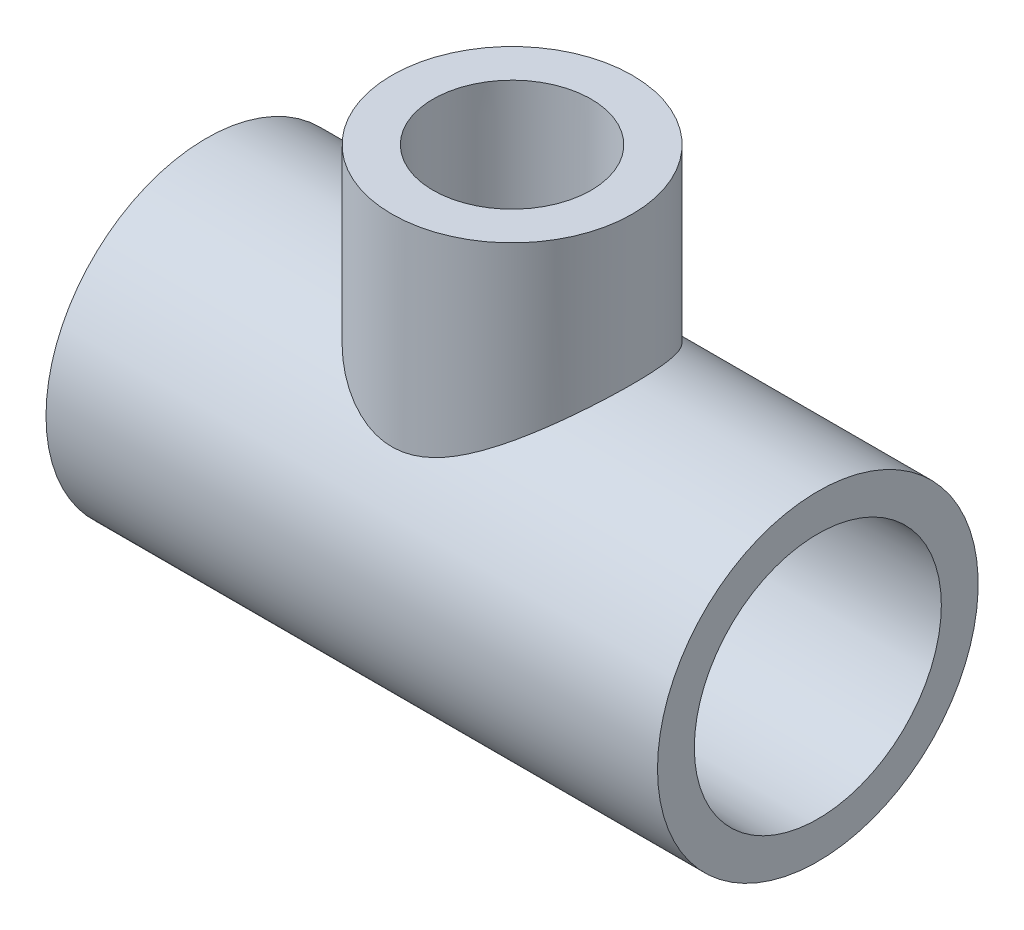
ISO-10303-21;
HEADER;
FILE_DESCRIPTION(('STEP AP214'),'2;1');
FILE_NAME('part.step','',(''),(''),'','','');
FILE_SCHEMA(('AUTOMOTIVE_DESIGN { 1 0 10303 214 1 1 1 1 }'));
ENDSEC;
DATA;
#1=APPLICATION_CONTEXT('core data for automotive mechanical design processes');
#2=APPLICATION_PROTOCOL_DEFINITION('international standard','automotive_design',2000,#1);
#3=PRODUCT_CONTEXT('',#1,'mechanical');
#4=PRODUCT('Part','Part','',(#3));
#5=PRODUCT_RELATED_PRODUCT_CATEGORY('part','',(#4));
#6=PRODUCT_DEFINITION_FORMATION('','',#4);
#7=PRODUCT_DEFINITION_CONTEXT('part definition',#1,'design');
#8=PRODUCT_DEFINITION('design','',#6,#7);
#9=PRODUCT_DEFINITION_SHAPE('','',#8);
#10=(LENGTH_UNIT() NAMED_UNIT(*) SI_UNIT(.MILLI.,.METRE.));
#11=(NAMED_UNIT(*) PLANE_ANGLE_UNIT() SI_UNIT($,.RADIAN.));
#12=(NAMED_UNIT(*) SI_UNIT($,.STERADIAN.) SOLID_ANGLE_UNIT());
#13=UNCERTAINTY_MEASURE_WITH_UNIT(LENGTH_MEASURE(1.E-05),#10,'distance_accuracy_value','');
#14=(GEOMETRIC_REPRESENTATION_CONTEXT(3) GLOBAL_UNCERTAINTY_ASSIGNED_CONTEXT((#13)) GLOBAL_UNIT_ASSIGNED_CONTEXT((#10,
#11,#12)) REPRESENTATION_CONTEXT('',''));
#15=CARTESIAN_POINT('',(0.,0.,0.));
#16=DIRECTION('',(0.,0.,1.));
#17=DIRECTION('',(1.,0.,0.));
#18=AXIS2_PLACEMENT_3D('',#15,#16,#17);
#19=CARTESIAN_POINT('',(-12.7,0.,0.));
#20=DIRECTION('',(1.,0.,0.));
#21=DIRECTION('',(0.,0.,-1.));
#22=AXIS2_PLACEMENT_3D('',#19,#20,#21);
#23=PLANE('',#22);
#24=CARTESIAN_POINT('',(-12.7,0.,0.));
#25=DIRECTION('',(-1.,0.,0.));
#26=DIRECTION('',(0.,0.,1.));
#27=AXIS2_PLACEMENT_3D('',#24,#25,#26);
#28=CIRCLE('',#27,16.637);
#29=CARTESIAN_POINT('',(-12.7,0.,16.637));
#30=VERTEX_POINT('',#29);
#31=EDGE_CURVE('E94',#30,#30,#28,.T.);
#32=ORIENTED_EDGE('',*,*,#31,.T.);
#33=EDGE_LOOP('',(#32));
#34=FACE_BOUND('',#33,.T.);
#35=CARTESIAN_POINT('',(-12.7,0.,0.));
#36=DIRECTION('',(1.,0.,0.));
#37=DIRECTION('',(0.,0.,-1.));
#38=AXIS2_PLACEMENT_3D('',#35,#36,#37);
#39=CIRCLE('',#38,12.1539);
#40=CARTESIAN_POINT('',(-12.7,0.,-12.1539));
#41=VERTEX_POINT('',#40);
#42=EDGE_CURVE('E97',#41,#41,#39,.T.);
#43=ORIENTED_EDGE('',*,*,#42,.T.);
#44=EDGE_LOOP('',(#43));
#45=FACE_BOUND('',#44,.T.);
#46=ADVANCED_FACE('F30',(#34,#45),#23,.F.);
#47=CARTESIAN_POINT('',(12.7,0.,0.));
#48=DIRECTION('',(1.,0.,0.));
#49=DIRECTION('',(0.,0.,-1.));
#50=AXIS2_PLACEMENT_3D('',#47,#48,#49);
#51=PLANE('',#50);
#52=CARTESIAN_POINT('',(12.7,0.,0.));
#53=DIRECTION('',(1.,0.,0.));
#54=DIRECTION('',(0.,0.,-1.));
#55=AXIS2_PLACEMENT_3D('',#52,#53,#54);
#56=CIRCLE('',#55,12.1539);
#57=CARTESIAN_POINT('',(12.7,0.,-12.1539));
#58=VERTEX_POINT('',#57);
#59=EDGE_CURVE('E100',#58,#58,#56,.T.);
#60=ORIENTED_EDGE('',*,*,#59,.F.);
#61=EDGE_LOOP('',(#60));
#62=FACE_BOUND('',#61,.T.);
#63=CARTESIAN_POINT('',(12.7,0.,0.));
#64=DIRECTION('',(1.,0.,0.));
#65=DIRECTION('',(0.,0.,-1.));
#66=AXIS2_PLACEMENT_3D('',#63,#64,#65);
#67=CIRCLE('',#66,16.637);
#68=CARTESIAN_POINT('',(12.7,0.,-16.637));
#69=VERTEX_POINT('',#68);
#70=EDGE_CURVE('E10',#69,#69,#67,.F.);
#71=ORIENTED_EDGE('',*,*,#70,.F.);
#72=EDGE_LOOP('',(#71));
#73=FACE_BOUND('',#72,.T.);
#74=ADVANCED_FACE('F69',(#62,#73),#51,.T.);
#75=CARTESIAN_POINT('',(12.7,0.,0.));
#76=DIRECTION('',(-1.,0.,0.));
#77=DIRECTION('',(0.,0.,1.));
#78=AXIS2_PLACEMENT_3D('',#75,#76,#77);
#79=CYLINDRICAL_SURFACE('',#78,21.844);
#80=CARTESIAN_POINT('',(-41.656,0.,0.));
#81=DIRECTION('',(-1.,0.,0.));
#82=DIRECTION('',(0.,0.,1.));
#83=AXIS2_PLACEMENT_3D('',#80,#81,#82);
#84=CIRCLE('',#83,21.844);
#85=CARTESIAN_POINT('',(-41.656,0.,21.844));
#86=VERTEX_POINT('',#85);
#87=EDGE_CURVE('E111',#86,#86,#84,.T.);
#88=ORIENTED_EDGE('',*,*,#87,.F.);
#89=EDGE_LOOP('',(#88));
#90=FACE_BOUND('',#89,.T.);
#91=CARTESIAN_POINT('',(41.656,0.,0.));
#92=DIRECTION('',(-1.,0.,0.));
#93=DIRECTION('',(0.,0.,1.));
#94=AXIS2_PLACEMENT_3D('',#91,#92,#93);
#95=CIRCLE('',#94,21.844);
#96=CARTESIAN_POINT('',(41.656,0.,21.844));
#97=VERTEX_POINT('',#96);
#98=EDGE_CURVE('E99',#97,#97,#95,.T.);
#99=ORIENTED_EDGE('',*,*,#98,.T.);
#100=EDGE_LOOP('',(#99));
#101=FACE_BOUND('',#100,.T.);
#102=CARTESIAN_POINT('',(-12.7,19.2366225465906,10.3495260277947));
#103=CARTESIAN_POINT('',(-12.38737162527,19.0302252353662,10.7331552467924));
#104=CARTESIAN_POINT('',(-12.0590114334823,18.8177169338673,11.1006174604114));
#105=CARTESIAN_POINT('',(-11.3728127983381,18.3855218332712,11.8026654761243));
#106=CARTESIAN_POINT('',(-11.0149596171085,18.1658314787354,12.1372346559506));
#107=CARTESIAN_POINT('',(-10.2706419831162,17.7243819909756,12.7732836382412));
#108=CARTESIAN_POINT('',(-9.88412017979884,17.5026195313519,13.0746939458155));
#109=CARTESIAN_POINT('',(-9.08404819443392,17.0635778234126,13.6427038422154));
#110=CARTESIAN_POINT('',(-8.67050700181132,16.8462971153419,13.9093149212335));
#111=CARTESIAN_POINT('',(-7.90903440214053,16.4689440947041,14.352691086896));
#112=CARTESIAN_POINT('',(-7.56624136939487,16.3066573784344,14.5364203328138));
#113=CARTESIAN_POINT('',(-6.86431224493976,15.9930557105811,14.8807494560404));
#114=CARTESIAN_POINT('',(-6.50517606181844,15.8417408203783,15.0413492039583));
#115=CARTESIAN_POINT('',(-5.77182638209687,15.5550006688472,15.3376890963806));
#116=CARTESIAN_POINT('',(-5.39765452404665,15.4195351086607,15.4734928040575));
#117=CARTESIAN_POINT('',(-4.63402477698114,15.1691094774438,15.7190730793771));
#118=CARTESIAN_POINT('',(-4.24456621640272,15.0541503085165,15.8288485020712));
#119=CARTESIAN_POINT('',(-3.54569518456714,14.8742744020657,15.9977413431733));
#120=CARTESIAN_POINT('',(-3.2390806564975,14.803950316516,16.0627000260346));
#121=CARTESIAN_POINT('',(-2.61935745093335,14.6808234658039,16.1753126147721));
#122=CARTESIAN_POINT('',(-2.30625269908129,14.6280104196909,16.2229766760936));
#123=CARTESIAN_POINT('',(-1.67544331465814,14.5419140056493,16.3001974153157));
#124=CARTESIAN_POINT('',(-1.35774345447337,14.5086116843102,16.3297716675336));
#125=CARTESIAN_POINT('',(-0.719641071933917,14.4628590160885,16.3703082945965));
#126=CARTESIAN_POINT('',(-0.39923854268686,14.450408722399,16.3812706219628));
#127=CARTESIAN_POINT('',(0.242445071122503,14.4469124642276,16.3843542346649));
#128=CARTESIAN_POINT('',(0.563726593949816,14.4559112128609,16.3764361615159));
#129=CARTESIAN_POINT('',(1.20396562771779,14.4950011021887,16.3418464983307));
#130=CARTESIAN_POINT('',(1.5229231476199,14.525092161507,16.315174980647));
#131=CARTESIAN_POINT('',(2.15662279904977,14.60512661813,16.2435672832095));
#132=CARTESIAN_POINT('',(2.47135944563514,14.655093664508,16.1986093442564));
#133=CARTESIAN_POINT('',(3.09441871182437,14.7729282615893,16.0912167549626));
#134=CARTESIAN_POINT('',(3.40274039319044,14.8407984111774,16.0287795671847));
#135=CARTESIAN_POINT('',(4.1072256247016,15.0158863092918,15.8651191251578));
#136=CARTESIAN_POINT('',(4.50058859868365,15.1287679837384,15.7578730388132));
#137=CARTESIAN_POINT('',(5.27212930843681,15.375930066885,15.5167930794521));
#138=CARTESIAN_POINT('',(5.65030187137645,15.5102176889498,15.3829502401131));
#139=CARTESIAN_POINT('',(6.39141830989837,15.7952708424237,15.0901154399997));
#140=CARTESIAN_POINT('',(6.75432459312845,15.9460740909881,14.9310655269177));
#141=CARTESIAN_POINT('',(7.46362496984504,16.2592155024214,14.5894471079966));
#142=CARTESIAN_POINT('',(7.81001888027989,16.4215537931151,14.406878341517));
#143=CARTESIAN_POINT('',(8.58466906108283,16.8020666999503,13.9627860748959));
#144=CARTESIAN_POINT('',(9.00740597239244,17.0227400315694,13.6937487511206));
#145=CARTESIAN_POINT('',(9.82490987765167,17.4690953555553,13.1195806907376));
#146=CARTESIAN_POINT('',(10.2196685254737,17.6947788163354,12.8144392558603));
#147=CARTESIAN_POINT('',(10.979990782657,18.1445312029231,12.1692594571232));
#148=CARTESIAN_POINT('',(11.3455747974031,18.3686011556714,11.8292458708072));
#149=CARTESIAN_POINT('',(12.0462308627125,18.809445592615,11.1149077204525));
#150=CARTESIAN_POINT('',(12.3813115447744,19.026222129607,10.7405929231314));
#151=CARTESIAN_POINT('',(12.9593802213773,19.4078672397707,10.0312370649456));
#152=CARTESIAN_POINT('',(13.2079017134634,19.5748881894783,9.70185098275879));
#153=CARTESIAN_POINT('',(13.6816294490335,19.8976019034885,9.0214999428057));
#154=CARTESIAN_POINT('',(13.906840106962,20.0532968109728,8.67053909085872));
#155=CARTESIAN_POINT('',(14.3318817379855,20.350366383037,7.94828592046748));
#156=CARTESIAN_POINT('',(14.5317377327227,20.49175513752,7.57701417239248));
#157=CARTESIAN_POINT('',(14.9042092723667,20.7575547244252,6.81519830278495));
#158=CARTESIAN_POINT('',(15.076827922905,20.8819674922488,6.4246563851336));
#159=CARTESIAN_POINT('',(15.3728204278317,21.0967352415774,5.67627570816755));
#160=CARTESIAN_POINT('',(15.499654276963,21.1894042517817,5.32046807040566));
#161=CARTESIAN_POINT('',(15.7293150014479,21.3579706401296,4.59730556156607));
#162=CARTESIAN_POINT('',(15.8321438758193,21.4338694147889,4.22995165489843));
#163=CARTESIAN_POINT('',(16.012416562649,21.567370306116,3.48592331677668));
#164=CARTESIAN_POINT('',(16.0898692080478,21.6249787890397,3.10925217766294));
#165=CARTESIAN_POINT('',(16.2183137953419,21.720716233426,2.34895879475537));
#166=CARTESIAN_POINT('',(16.2693055289336,21.7588450415423,1.96533649626579));
#167=CARTESIAN_POINT('',(16.3441444391592,21.8148592628047,1.19277030180853));
#168=CARTESIAN_POINT('',(16.3679073133331,21.8326818053666,0.803813631535926));
#169=CARTESIAN_POINT('',(16.3876138015941,21.8474595807421,0.0247951359414509));
#170=CARTESIAN_POINT('',(16.3835573098497,21.8444147341713,-0.365266693579066));
#171=CARTESIAN_POINT('',(16.34769047214,21.817527153199,-1.14343296098828));
#172=CARTESIAN_POINT('',(16.3158766473305,21.7936818118584,-1.53153714739183));
#173=CARTESIAN_POINT('',(16.2250078207658,21.7257362675007,-2.30272862769891));
#174=CARTESIAN_POINT('',(16.1659534551356,21.6816365374672,-2.68581603854008));
#175=CARTESIAN_POINT('',(16.0250115285092,21.5767592765038,-3.42588372631266));
#176=CARTESIAN_POINT('',(15.9443647720213,21.5168903053893,-3.78323120297709));
#177=CARTESIAN_POINT('',(15.7602764895552,21.3808353397447,-4.48879868540526));
#178=CARTESIAN_POINT('',(15.6568354580999,21.3046496992065,-4.8370188890023));
#179=CARTESIAN_POINT('',(15.4283792222684,21.1373243324452,-5.52252667614755));
#180=CARTESIAN_POINT('',(15.3033679608905,21.0461873394515,-5.85981624443428));
#181=CARTESIAN_POINT('',(15.0330756219717,20.8504759794269,-6.52206352972874));
#182=CARTESIAN_POINT('',(14.8877948143536,20.7459017913362,-6.84702141088019));
#183=CARTESIAN_POINT('',(14.4521370418577,20.434848871702,-7.74276698396327));
#184=CARTESIAN_POINT('',(14.139905927436,20.2147040312702,-8.29837024666278));
#185=CARTESIAN_POINT('',(13.4600371329359,19.7451188515364,-9.3610153478605));
#186=CARTESIAN_POINT('',(13.0923773967042,19.4956668590949,-9.86803772310501));
#187=CARTESIAN_POINT('',(12.3872653792398,19.0301577361515,-10.7332842759314));
#188=CARTESIAN_POINT('',(12.0588288904482,18.8175994143986,-11.1008220323835));
#189=CARTESIAN_POINT('',(11.3724689478728,18.3853078150025,-11.8029994320256));
#190=CARTESIAN_POINT('',(11.0145330614889,18.165571535984,-12.1376250726524));
#191=CARTESIAN_POINT('',(10.2702049880416,17.7241297925255,-12.7736310771484));
#192=CARTESIAN_POINT('',(9.88376741173228,17.5024217041293,-13.0749564169108));
#193=CARTESIAN_POINT('',(9.08386751925894,17.0634829269642,-13.6428200841769));
#194=CARTESIAN_POINT('',(8.67041365409696,16.8462508657463,-13.9093692126307));
#195=CARTESIAN_POINT('',(7.9090490445422,16.4689513433912,-14.3526826093123));
#196=CARTESIAN_POINT('',(7.56627148900179,16.3066716372532,-14.5364042016123));
#197=CARTESIAN_POINT('',(6.86437619967367,15.9930834815055,-14.8807194390151));
#198=CARTESIAN_POINT('',(6.50525844431151,15.8417750463823,-15.0413130535801));
#199=CARTESIAN_POINT('',(5.77191248532007,15.5550323267804,-15.3376571552622));
#200=CARTESIAN_POINT('',(5.39772441046526,15.419559205897,-15.4734689002737));
#201=CARTESIAN_POINT('',(4.63406076138454,15.1691201011686,-15.7190629343969));
#202=CARTESIAN_POINT('',(4.24458451590511,15.0541550189959,-15.828844079097));
#203=CARTESIAN_POINT('',(3.54569259816477,14.8742737359624,-15.9977419686909));
#204=CARTESIAN_POINT('',(3.23907542034374,14.8039491154811,-16.0627011355186));
#205=CARTESIAN_POINT('',(2.61934682255104,14.6808215146596,-16.17531438826));
#206=CARTESIAN_POINT('',(2.30623932853355,14.6280082525291,-16.2229786304416));
#207=CARTESIAN_POINT('',(1.67542979324863,14.5419125019922,-16.3001987533026));
#208=CARTESIAN_POINT('',(1.35773260789967,14.508610728243,-16.3297725160643));
#209=CARTESIAN_POINT('',(0.719635624006332,14.4628588037718,-16.3703084812258));
#210=CARTESIAN_POINT('',(0.399235818422133,14.4504087073815,-16.3812706351307));
#211=CARTESIAN_POINT('',(-0.242444828856007,14.4469124657222,-16.384354233424));
#212=CARTESIAN_POINT('',(-0.563726110444523,14.455911199315,-16.3764361734293));
#213=CARTESIAN_POINT('',(-1.20396466559519,14.495001027467,-16.3418465645212));
#214=CARTESIAN_POINT('',(-1.52292194812461,14.5250920405968,-16.3151750880076));
#215=CARTESIAN_POINT('',(-2.15662161334648,14.6051264377492,-16.2435674454124));
#216=CARTESIAN_POINT('',(-2.471358504164,14.6550935007574,-16.1986094926111));
#217=CARTESIAN_POINT('',(-3.09441824921853,14.7729281597842,-16.0912168486278));
#218=CARTESIAN_POINT('',(-3.40274016524305,14.8407983546182,-16.0287796200765));
#219=CARTESIAN_POINT('',(-4.10722201649837,15.0158854124114,-15.8651199634701));
#220=CARTESIAN_POINT('',(-4.50058150075528,15.1287659464657,-15.7578749742277));
#221=CARTESIAN_POINT('',(-5.27211551479685,15.3759254111821,-15.5167976722339));
#222=CARTESIAN_POINT('',(-5.65028487204106,15.5102115548262,-15.3829563936505));
#223=CARTESIAN_POINT('',(-6.39140187585219,15.7952641161734,-15.0901224981788));
#224=CARTESIAN_POINT('',(-6.75431163976959,15.946068542545,-14.9310714813334));
#225=CARTESIAN_POINT('',(-7.46361870433724,16.2592125661498,-14.5894504099462));
#226=CARTESIAN_POINT('',(-7.81001582075484,16.4215522920328,-14.4068800930821));
#227=CARTESIAN_POINT('',(-8.58470082990844,16.8020823026998,-13.9627678655324));
#228=CARTESIAN_POINT('',(-9.007467507504,17.0227721429695,-13.6937096032207));
#229=CARTESIAN_POINT('',(-9.82502683065921,17.4691606978136,-13.1194944767923));
#230=CARTESIAN_POINT('',(-10.2198111328941,17.6948608801674,-12.814326917995));
#231=CARTESIAN_POINT('',(-10.9801246215167,18.1446126626921,-12.1691372179985));
#232=CARTESIAN_POINT('',(-11.345678430233,18.3686655028908,-11.8291449740616));
#233=CARTESIAN_POINT('',(-12.0462795122101,18.8094770590939,-11.1148533627338));
#234=CARTESIAN_POINT('',(-12.3813353849971,19.0262378203158,-10.7405637263119));
#235=CARTESIAN_POINT('',(-12.9569700808324,19.4062760869321,-10.0341945342256));
#236=CARTESIAN_POINT('',(-13.2032813271431,19.5717834475051,-9.70797218500756));
#237=CARTESIAN_POINT('',(-13.6730359552688,19.8917062444322,-9.03434158232512));
#238=CARTESIAN_POINT('',(-13.8964835643905,20.0461237296374,-8.68693726426536));
#239=CARTESIAN_POINT('',(-14.3186219587609,20.3410371964566,-7.97195154521792));
#240=CARTESIAN_POINT('',(-14.517323478962,20.4815392092045,-7.60437899368232));
#241=CARTESIAN_POINT('',(-14.8880363000146,20.745948850715,-6.85022484967885));
#242=CARTESIAN_POINT('',(-15.0600472360499,20.8698562526534,-6.46364299748025));
#243=CARTESIAN_POINT('',(-15.3765600199866,21.0993902064612,-5.669934690412));
#244=CARTESIAN_POINT('',(-15.5208127789903,21.2048505203159,-5.26266023989252));
#245=CARTESIAN_POINT('',(-15.7777566772591,21.3936358143847,-4.43323095134312));
#246=CARTESIAN_POINT('',(-15.8904476366134,21.4769606684207,-4.01107602850599));
#247=CARTESIAN_POINT('',(-16.0822115542369,21.6192285336021,-3.1555005892666));
#248=CARTESIAN_POINT('',(-16.1613113481145,21.6781910065607,-2.72208936027868));
#249=CARTESIAN_POINT('',(-16.2844682263145,21.7701599425394,-1.84760907958934));
#250=CARTESIAN_POINT('',(-16.3285302820107,21.8031700878311,-1.40654112335023));
#251=CARTESIAN_POINT('',(-16.3776133924225,21.8399555124246,-0.573782158080361));
#252=CARTESIAN_POINT('',(-16.3866525216412,21.8467394077374,-0.182453784838107));
#253=CARTESIAN_POINT('',(-16.3766916949093,21.8392687900042,0.599624918026777));
#254=CARTESIAN_POINT('',(-16.3576941420537,21.8250160800589,0.990375294317498));
#255=CARTESIAN_POINT('',(-16.2919737390921,21.775802728388,1.76823726852129));
#256=CARTESIAN_POINT('',(-16.2452485994021,21.7408403765803,2.15534856325815));
#257=CARTESIAN_POINT('',(-16.1248184607816,21.6510002098822,2.92298920804496));
#258=CARTESIAN_POINT('',(-16.0511135051687,21.5961224269673,3.30351856866152));
#259=CARTESIAN_POINT('',(-15.8819272449672,21.4706823217068,4.03759808020127));
#260=CARTESIAN_POINT('',(-15.7876398484969,21.4009839203307,4.39157331041529));
#261=CARTESIAN_POINT('',(-15.5767452554425,21.2458827986697,5.08925487343198));
#262=CARTESIAN_POINT('',(-15.4601382870945,21.1604802389733,5.43296131120001));
#263=CARTESIAN_POINT('',(-15.2059331208692,20.9754726227097,6.10839131623331));
#264=CARTESIAN_POINT('',(-15.0683434726113,20.8758733518209,6.44011969630656));
#265=CARTESIAN_POINT('',(-14.7734833020126,20.6640497733413,7.09044314295109));
#266=CARTESIAN_POINT('',(-14.616214252921,20.5518264108851,7.40903919027058));
#267=CARTESIAN_POINT('',(-14.1976858581015,20.2558653455779,8.1923320371806));
#268=CARTESIAN_POINT('',(-13.9245015201782,20.065000115315,8.64802781048831));
#269=CARTESIAN_POINT('',(-13.3400105891244,19.6638836910127,9.52495035865812));
#270=CARTESIAN_POINT('',(-13.0287007745727,19.4536308591848,9.94617421578406));
#271=CARTESIAN_POINT('',(-12.7,19.2366225465906,10.3495260277947));
#272=B_SPLINE_CURVE_WITH_KNOTS('',3,(#102,#103,#104,#105,#106,#107,#108,#109,#110,#111,#112,
#113,#114,#115,#116,#117,#118,#119,#120,#121,#122,#123,#124,#125,#126,#127,#128,#129,#130,#131,
#132,#133,#134,#135,#136,#137,#138,#139,#140,#141,#142,#143,#144,#145,#146,#147,#148,#149,#150,
#151,#152,#153,#154,#155,#156,#157,#158,#159,#160,#161,#162,#163,#164,#165,#166,#167,#168,#169,
#170,#171,#172,#173,#174,#175,#176,#177,#178,#179,#180,#181,#182,#183,#184,#185,#186,#187,#188,
#189,#190,#191,#192,#193,#194,#195,#196,#197,#198,#199,#200,#201,#202,#203,#204,#205,#206,#207,
#208,#209,#210,#211,#212,#213,#214,#215,#216,#217,#218,#219,#220,#221,#222,#223,#224,#225,#226,
#227,#228,#229,#230,#231,#232,#233,#234,#235,#236,#237,#238,#239,#240,#241,#242,#243,#244,#245,
#246,#247,#248,#249,#250,#251,#252,#253,#254,#255,#256,#257,#258,#259,#260,#261,#262,#263,#264,
#265,#266,#267,#268,#269,#270,#271),.UNSPECIFIED.,.T.,.F.,(4,2,2,2,2,2,2,2,2,2,2,2,2,2,2,2,2,2,
2,2,2,2,2,2,2,2,2,2,2,2,2,2,2,2,2,2,2,2,2,2,2,2,2,2,2,2,2,2,2,2,2,2,2,2,2,2,2,2,2,2,2,2,2,2,2,2,
2,2,2,2,2,2,2,2,2,2,2,2,2,2,2,2,2,2,4),(0.,1.60806818770395,3.21694486907234,4.82913168174983,
6.44078482018501,7.70409416117813,8.96741056908732,10.2274416256177,11.4875280989114,
12.4502640819248,13.4124338255557,14.3736673268541,15.3349032802386,16.2981447977918,
17.2613825990831,18.2257699356212,19.1902973435201,20.4575371076236,21.7252048117819,
22.9958303929922,24.2664700567375,25.9069541672427,27.5479256045885,29.1877390633505,
30.827087053866,32.1613507767027,33.4953613618423,34.8280450441414,36.1605766624227,
37.3261976190015,38.4917214736682,39.6568392015041,40.8219661011469,41.9906906506002,
43.1594196461623,44.3282951403197,45.4971433401114,46.6095282329791,47.7218889949757,
48.8340466344709,49.9461894651439,51.9635148508238,53.9816450996393,55.5901454957105,
57.199327299655,58.8111295034902,60.4224299088605,61.6856837349756,62.94893922905,
64.2090285029533,65.4691731652727,66.4319173637277,67.3940952819771,68.3553205628936,
69.3165483483966,70.2797891418503,71.2430262166179,72.2074142804695,73.1719424118293,
74.4391707471172,75.706827002622,76.9774639795346,78.2481151297073,79.8887186124941,
81.5298092234663,83.1695025699854,84.8087321293215,86.1306013690602,87.4522257622576,
88.773274817535,90.0943419277867,91.4267610577487,92.7591877826999,94.0905480351028,
95.4217193520438,96.5946603481835,97.7675008144201,98.9404381405297,100.113373583432,
101.230870494984,102.348355979817,103.46538734373,104.582335133855,106.272932061668,
107.963671935553),.UNSPECIFIED.);
#273=CARTESIAN_POINT('',(-12.7,19.2366225465906,10.3495260277947));
#274=VERTEX_POINT('',#273);
#275=EDGE_CURVE('E52',#274,#274,#272,.T.);
#276=ORIENTED_EDGE('',*,*,#275,.F.);
#277=EDGE_LOOP('',(#276));
#278=FACE_BOUND('',#277,.T.);
#279=ADVANCED_FACE('F64',(#90,#101,#278),#79,.T.);
#280=CARTESIAN_POINT('',(-12.7,0.,0.));
#281=DIRECTION('',(-1.,0.,0.));
#282=DIRECTION('',(0.,0.,1.));
#283=AXIS2_PLACEMENT_3D('',#280,#281,#282);
#284=CONICAL_SURFACE('',#283,16.637,0.00657885245301647);
#285=CARTESIAN_POINT('',(-41.656,0.,0.));
#286=DIRECTION('',(-1.,0.,0.));
#287=DIRECTION('',(0.,0.,1.));
#288=AXIS2_PLACEMENT_3D('',#285,#286,#287);
#289=CIRCLE('',#288,16.8275);
#290=CARTESIAN_POINT('',(-41.656,0.,16.8275));
#291=VERTEX_POINT('',#290);
#292=EDGE_CURVE('E59',#291,#291,#289,.T.);
#293=ORIENTED_EDGE('',*,*,#292,.T.);
#294=EDGE_LOOP('',(#293));
#295=FACE_BOUND('',#294,.T.);
#296=ORIENTED_EDGE('',*,*,#31,.F.);
#297=EDGE_LOOP('',(#296));
#298=FACE_BOUND('',#297,.T.);
#299=ADVANCED_FACE('F68',(#295,#298),#284,.F.);
#300=CARTESIAN_POINT('',(41.656,0.,0.));
#301=DIRECTION('',(1.,0.,0.));
#302=DIRECTION('',(0.,0.,-1.));
#303=AXIS2_PLACEMENT_3D('',#300,#301,#302);
#304=CONICAL_SURFACE('',#303,16.8275,0.00657885245301623);
#305=CARTESIAN_POINT('',(41.656,0.,0.));
#306=DIRECTION('',(-1.,0.,0.));
#307=DIRECTION('',(0.,0.,1.));
#308=AXIS2_PLACEMENT_3D('',#305,#306,#307);
#309=CIRCLE('',#308,16.8275);
#310=CARTESIAN_POINT('',(41.656,0.,16.8275));
#311=VERTEX_POINT('',#310);
#312=EDGE_CURVE('E103',#311,#311,#309,.T.);
#313=ORIENTED_EDGE('',*,*,#312,.F.);
#314=EDGE_LOOP('',(#313));
#315=FACE_BOUND('',#314,.T.);
#316=ORIENTED_EDGE('',*,*,#70,.T.);
#317=EDGE_LOOP('',(#316));
#318=FACE_BOUND('',#317,.T.);
#319=ADVANCED_FACE('F81',(#315,#318),#304,.F.);
#320=CARTESIAN_POINT('',(0.,0.,0.));
#321=DIRECTION('',(0.,-1.,0.));
#322=DIRECTION('',(1.,0.,0.));
#323=AXIS2_PLACEMENT_3D('',#320,#321,#322);
#324=CYLINDRICAL_SURFACE('',#323,16.383);
#325=ORIENTED_EDGE('',*,*,#275,.T.);
#326=EDGE_LOOP('',(#325));
#327=FACE_BOUND('',#326,.T.);
#328=CARTESIAN_POINT('',(0.,41.91,0.));
#329=DIRECTION('',(0.,-1.,0.));
#330=DIRECTION('',(1.,0.,0.));
#331=AXIS2_PLACEMENT_3D('',#328,#329,#330);
#332=CIRCLE('',#331,16.383);
#333=CARTESIAN_POINT('',(16.383,41.91,0.));
#334=VERTEX_POINT('',#333);
#335=EDGE_CURVE('E43',#334,#334,#332,.T.);
#336=ORIENTED_EDGE('',*,*,#335,.T.);
#337=EDGE_LOOP('',(#336));
#338=FACE_BOUND('',#337,.T.);
#339=ADVANCED_FACE('F61',(#327,#338),#324,.T.);
#340=CARTESIAN_POINT('',(0.,41.91,0.));
#341=DIRECTION('',(0.,1.,0.));
#342=DIRECTION('',(-1.,0.,0.));
#343=AXIS2_PLACEMENT_3D('',#340,#341,#342);
#344=CONICAL_SURFACE('',#343,10.7696,0.00666656790386833);
#345=CARTESIAN_POINT('',(0.,41.91,0.));
#346=DIRECTION('',(0.,-1.,0.));
#347=DIRECTION('',(1.,0.,0.));
#348=AXIS2_PLACEMENT_3D('',#345,#346,#347);
#349=CIRCLE('',#348,10.7696);
#350=CARTESIAN_POINT('',(10.7696,41.91,0.));
#351=VERTEX_POINT('',#350);
#352=EDGE_CURVE('E47',#351,#351,#349,.T.);
#353=ORIENTED_EDGE('',*,*,#352,.F.);
#354=EDGE_LOOP('',(#353));
#355=FACE_BOUND('',#354,.T.);
#356=CARTESIAN_POINT('',(0.,19.05,0.));
#357=DIRECTION('',(0.,-1.,0.));
#358=DIRECTION('',(1.,0.,0.));
#359=AXIS2_PLACEMENT_3D('',#356,#357,#358);
#360=CIRCLE('',#359,10.6172);
#361=CARTESIAN_POINT('',(10.6172,19.05,0.));
#362=VERTEX_POINT('',#361);
#363=EDGE_CURVE('E153',#362,#362,#360,.T.);
#364=ORIENTED_EDGE('',*,*,#363,.T.);
#365=EDGE_LOOP('',(#364));
#366=FACE_BOUND('',#365,.T.);
#367=ADVANCED_FACE('F72',(#355,#366),#344,.F.);
#368=CARTESIAN_POINT('',(16.383,41.91,0.));
#369=DIRECTION('',(0.,1.,0.));
#370=DIRECTION('',(-1.,0.,0.));
#371=AXIS2_PLACEMENT_3D('',#368,#369,#370);
#372=PLANE('',#371);
#373=ORIENTED_EDGE('',*,*,#352,.T.);
#374=EDGE_LOOP('',(#373));
#375=FACE_BOUND('',#374,.T.);
#376=ORIENTED_EDGE('',*,*,#335,.F.);
#377=EDGE_LOOP('',(#376));
#378=FACE_BOUND('',#377,.T.);
#379=ADVANCED_FACE('F32',(#375,#378),#372,.T.);
#380=CARTESIAN_POINT('',(-41.656,-21.844,0.));
#381=DIRECTION('',(-1.,0.,0.));
#382=DIRECTION('',(0.,0.,1.));
#383=AXIS2_PLACEMENT_3D('',#380,#381,#382);
#384=PLANE('',#383);
#385=ORIENTED_EDGE('',*,*,#87,.T.);
#386=EDGE_LOOP('',(#385));
#387=FACE_BOUND('',#386,.T.);
#388=ORIENTED_EDGE('',*,*,#292,.F.);
#389=EDGE_LOOP('',(#388));
#390=FACE_BOUND('',#389,.T.);
#391=ADVANCED_FACE('F79',(#387,#390),#384,.T.);
#392=CARTESIAN_POINT('',(41.656,-21.844,0.));
#393=DIRECTION('',(1.,0.,0.));
#394=DIRECTION('',(0.,0.,-1.));
#395=AXIS2_PLACEMENT_3D('',#392,#393,#394);
#396=PLANE('',#395);
#397=ORIENTED_EDGE('',*,*,#312,.T.);
#398=EDGE_LOOP('',(#397));
#399=FACE_BOUND('',#398,.T.);
#400=ORIENTED_EDGE('',*,*,#98,.F.);
#401=EDGE_LOOP('',(#400));
#402=FACE_BOUND('',#401,.T.);
#403=ADVANCED_FACE('F119',(#399,#402),#396,.T.);
#404=CARTESIAN_POINT('',(41.656,0.,0.));
#405=DIRECTION('',(1.,0.,0.));
#406=DIRECTION('',(0.,0.,-1.));
#407=AXIS2_PLACEMENT_3D('',#404,#405,#406);
#408=CYLINDRICAL_SURFACE('',#407,12.1539);
#409=CARTESIAN_POINT('',(6.9342,12.1539,0.));
#410=CARTESIAN_POINT('',(6.9341984706074,12.1538986146855,0.178899022117885));
#411=CARTESIAN_POINT('',(6.92726573928938,12.1499396384265,0.35785483206644));
#412=CARTESIAN_POINT('',(6.89961826360863,12.1341980550252,0.714431213734417));
#413=CARTESIAN_POINT('',(6.87889482492848,12.1224105123918,0.892050871594168));
#414=CARTESIAN_POINT('',(6.82388106850625,12.0912775486895,1.24487484077577));
#415=CARTESIAN_POINT('',(6.78956353864786,12.0719169691948,1.42007357351879));
#416=CARTESIAN_POINT('',(6.707780716166,12.0261104234143,1.76649458671966));
#417=CARTESIAN_POINT('',(6.66030980758272,11.9996614308218,1.93771513473389));
#418=CARTESIAN_POINT('',(6.55305344310424,11.9404636867739,2.27411951053277));
#419=CARTESIAN_POINT('',(6.49333355556651,11.907748537115,2.4393301821606));
#420=CARTESIAN_POINT('',(6.36203824221624,11.8366656765617,2.76373953906899));
#421=CARTESIAN_POINT('',(6.2904584971124,11.7982959068523,2.92293600797681));
#422=CARTESIAN_POINT('',(6.05900584325196,11.6759771878069,3.39000606669478));
#423=CARTESIAN_POINT('',(5.88227912838597,11.5847390828764,3.6877949738225));
#424=CARTESIAN_POINT('',(5.47476818789375,11.3830425146343,4.27151570367551));
#425=CARTESIAN_POINT('',(5.24100492263414,11.271672516023,4.55504423539834));
#426=CARTESIAN_POINT('',(4.8600282953166,11.1014033758584,4.94942062835055));
#427=CARTESIAN_POINT('',(4.72784844976238,11.0440583682038,5.07582625953789));
#428=CARTESIAN_POINT('',(4.45381902937635,10.9295539878446,5.31789784962668));
#429=CARTESIAN_POINT('',(4.31196767831036,10.8723946512701,5.43356182649067));
#430=CARTESIAN_POINT('',(4.00327988227644,10.7535099449959,5.66551798380743));
#431=CARTESIAN_POINT('',(3.83540219500916,10.6919616904597,5.78051783649459));
#432=CARTESIAN_POINT('',(3.48919791079468,10.572712983492,5.99584628201391));
#433=CARTESIAN_POINT('',(3.31087226234474,10.5150121827908,6.09617620374461));
#434=CARTESIAN_POINT('',(2.94478725107378,10.4055494299031,6.28119196037955));
#435=CARTESIAN_POINT('',(2.75703865795137,10.3537809102574,6.36589515983074));
#436=CARTESIAN_POINT('',(2.37300256886104,10.2582045652774,6.51879325673181));
#437=CARTESIAN_POINT('',(2.17671788730288,10.2143941403983,6.58699354735238));
#438=CARTESIAN_POINT('',(1.8211319110445,10.145310258192,6.6927589216083));
#439=CARTESIAN_POINT('',(1.6632264548705,10.1180795890046,6.7337632335901));
#440=CARTESIAN_POINT('',(1.34393588635314,10.0705223346196,6.80468177384208));
#441=CARTESIAN_POINT('',(1.18255151998459,10.0501942846658,6.83459835508478));
#442=CARTESIAN_POINT('',(0.857439843562082,10.0171470194496,6.88294347349029));
#443=CARTESIAN_POINT('',(0.693714715979769,10.0044211365371,6.90138207826679));
#444=CARTESIAN_POINT('',(0.36493201273917,9.98701090784835,6.92655289640303));
#445=CARTESIAN_POINT('',(0.199874410479211,9.98232672301835,6.93328487546685));
#446=CARTESIAN_POINT('',(-0.130550826400039,9.98117567488056,6.9349418622879));
#447=CARTESIAN_POINT('',(-0.295918579741258,9.98471985252118,6.9298510059727));
#448=CARTESIAN_POINT('',(-0.625491903976526,9.99991473425395,6.90790608397957));
#449=CARTESIAN_POINT('',(-0.789697470311797,10.011565470127,6.89105197218507));
#450=CARTESIAN_POINT('',(-1.11583409009281,10.0425531292693,6.84581331937471));
#451=CARTESIAN_POINT('',(-1.27776422828163,10.0618930586715,6.81742426861483));
#452=CARTESIAN_POINT('',(-1.59830784593727,10.1075990731355,6.74947397647237));
#453=CARTESIAN_POINT('',(-1.75691995735716,10.1339679970385,6.70990822070198));
#454=CARTESIAN_POINT('',(-2.06924882336491,10.1927678317315,6.62024374662239));
#455=CARTESIAN_POINT('',(-2.22298303821868,10.2251733479836,6.57018904653299));
#456=CARTESIAN_POINT('',(-2.52556663358769,10.2951908362797,6.45992202687647));
#457=CARTESIAN_POINT('',(-2.6744143897759,10.3328045183393,6.39970636970049));
#458=CARTESIAN_POINT('',(-3.11270246572554,10.4519890593267,6.20455147376694));
#459=CARTESIAN_POINT('',(-3.39404166737462,10.5399340727645,6.05505950026536));
#460=CARTESIAN_POINT('',(-3.97448887670467,10.7398727274212,5.69397653895983));
#461=CARTESIAN_POINT('',(-4.26925306939877,10.8534636292828,5.47627976398346));
#462=CARTESIAN_POINT('',(-4.68271340778037,11.0248022792239,5.11748981282796));
#463=CARTESIAN_POINT('',(-4.81584052280983,11.0821167058005,4.99241436001082));
#464=CARTESIAN_POINT('',(-5.07205785583648,11.1958355480097,4.73188428868492));
#465=CARTESIAN_POINT('',(-5.19514637619756,11.252239808435,4.59642792213194));
#466=CARTESIAN_POINT('',(-5.44399833425791,11.3691633917313,4.29972586003496));
#467=CARTESIAN_POINT('',(-5.56847805973831,11.4294225900968,4.13729838438937));
#468=CARTESIAN_POINT('',(-5.80318281119971,11.5455919526997,3.80107976288375));
#469=CARTESIAN_POINT('',(-5.9134136229616,11.6015038784515,3.62729327279196));
#470=CARTESIAN_POINT('',(-6.11862658913763,11.7074346202837,3.26926579006421));
#471=CARTESIAN_POINT('',(-6.2136120331192,11.7574547070534,3.08502706440192));
#472=CARTESIAN_POINT('',(-6.38726668289194,11.8501450586233,2.70724141592276));
#473=CARTESIAN_POINT('',(-6.46593791047876,11.8928162340516,2.51369565017964));
#474=CARTESIAN_POINT('',(-6.6010569640369,11.9668350732432,2.13241813247799));
#475=CARTESIAN_POINT('',(-6.65866567446041,11.9987618691761,1.94521041537765));
#476=CARTESIAN_POINT('',(-6.75804363970582,12.0541945208625,1.56540630251364));
#477=CARTESIAN_POINT('',(-6.79981347378992,12.0777006845751,1.37281010409514));
#478=CARTESIAN_POINT('',(-6.86685348265552,12.1155712736649,0.984037984278856));
#479=CARTESIAN_POINT('',(-6.89213712320362,12.1299431595904,0.787865119252796));
#480=CARTESIAN_POINT('',(-6.92584443394612,12.1491267689415,0.393618798961867));
#481=CARTESIAN_POINT('',(-6.93426997779457,12.1539395547906,0.195545557368958));
#482=CARTESIAN_POINT('',(-6.93413763828238,12.1538647456794,-0.17659432339035));
#483=CARTESIAN_POINT('',(-6.92751144775087,12.1500804650838,-0.350665680617742));
#484=CARTESIAN_POINT('',(-6.90122186902757,12.1351102367962,-0.697501011086354));
#485=CARTESIAN_POINT('',(-6.88155869092762,12.1239244083806,-0.870265005350428));
#486=CARTESIAN_POINT('',(-6.8294445447062,12.0944205394509,-1.2132197762611));
#487=CARTESIAN_POINT('',(-6.79699416254854,12.0761028257506,-1.38341067044701));
#488=CARTESIAN_POINT('',(-6.71969470682679,12.032764843048,-1.72007778108691));
#489=CARTESIAN_POINT('',(-6.67484525654599,12.0077443703988,-1.88655388450955));
#490=CARTESIAN_POINT('',(-6.57375356108645,11.9518464601234,-2.21309866691111));
#491=CARTESIAN_POINT('',(-6.51763144920883,11.9210309841782,-2.37321519991085));
#492=CARTESIAN_POINT('',(-6.39426125766886,11.854031488141,-2.68796502841398));
#493=CARTESIAN_POINT('',(-6.3270095677412,11.8178457264047,-2.84259652482505));
#494=CARTESIAN_POINT('',(-6.1094478497723,11.7023205691266,-3.29703794796215));
#495=CARTESIAN_POINT('',(-5.94326042138085,11.6159731144519,-3.58762058709458));
#496=CARTESIAN_POINT('',(-5.55387842394895,11.4213995631103,-4.16799232863491));
#497=CARTESIAN_POINT('',(-5.32655137726909,11.3118318091934,-4.4545526348761));
#498=CARTESIAN_POINT('',(-4.95514952447281,11.1434070843817,-4.85415285653455));
#499=CARTESIAN_POINT('',(-4.82615286695885,11.0865345906315,-4.98241283563565));
#500=CARTESIAN_POINT('',(-4.55846776689363,10.9726523100266,-5.22843502892021));
#501=CARTESIAN_POINT('',(-4.4197777091984,10.9156425018274,-5.34619548616669));
#502=CARTESIAN_POINT('',(-4.11734553958013,10.7965402873267,-5.58314374397743));
#503=CARTESIAN_POINT('',(-3.95253209927349,10.7345869861929,-5.70103626141756));
#504=CARTESIAN_POINT('',(-3.61235031822474,10.6140445453581,-5.92243450125259));
#505=CARTESIAN_POINT('',(-3.43698276754789,10.5554551544796,-6.02594129862655));
#506=CARTESIAN_POINT('',(-3.0766394810966,10.443685234957,-6.21763839903332));
#507=CARTESIAN_POINT('',(-2.89167327847593,10.3904994891857,-6.30584353491952));
#508=CARTESIAN_POINT('',(-2.51297724591471,10.2915427104768,-6.46608941537712));
#509=CARTESIAN_POINT('',(-2.31925012875243,10.2457694021505,-6.53813512301719));
#510=CARTESIAN_POINT('',(-1.96642438142444,10.1724073264758,-6.6515373794734));
#511=CARTESIAN_POINT('',(-1.8087433196319,10.1430220575726,-6.69616207664332));
#512=CARTESIAN_POINT('',(-1.48957546034698,10.0909970453449,-6.77430977074261));
#513=CARTESIAN_POINT('',(-1.32808948084806,10.0683558661779,-6.80783513093316));
#514=CARTESIAN_POINT('',(-1.00242564602197,10.0305974151301,-6.86334688925987));
#515=CARTESIAN_POINT('',(-0.838250428192771,10.015473179641,-6.88534396809336));
#516=CARTESIAN_POINT('',(-0.50819669903322,9.99326346600638,-6.91753974124526));
#517=CARTESIAN_POINT('',(-0.342318160960878,9.98617811426593,-6.9277382500405));
#518=CARTESIAN_POINT('',(-0.00977974901527454,9.98030868529556,-6.93619141391718));
#519=CARTESIAN_POINT('',(0.156881021225505,9.98154104789107,-6.9344224154014));
#520=CARTESIAN_POINT('',(0.489372087280443,9.9922984770658,-6.91891203807099));
#521=CARTESIAN_POINT('',(0.655202380021083,10.0018235743129,-6.90517061498041));
#522=CARTESIAN_POINT('',(0.984859399328532,10.0288135826184,-6.86591198316468));
#523=CARTESIAN_POINT('',(1.14868540978953,10.0462812510186,-6.84039068489344));
#524=CARTESIAN_POINT('',(1.47323548755988,10.0885416057476,-6.77790764407044));
#525=CARTESIAN_POINT('',(1.63395827376146,10.1133372512085,-6.74094127956521));
#526=CARTESIAN_POINT('',(1.94861005133145,10.1689557957374,-6.65673503025219));
#527=CARTESIAN_POINT('',(2.10260802521061,10.1996693898728,-6.60967993425488));
#528=CARTESIAN_POINT('',(2.4059434431263,10.2664894732625,-6.50540612070046));
#529=CARTESIAN_POINT('',(2.55527934197802,10.3025977280409,-6.44818407461592));
#530=CARTESIAN_POINT('',(2.99532552481771,10.4175826112581,-6.26199315957515));
#531=CARTESIAN_POINT('',(3.27823504318628,10.5031494441995,-6.11845589735874));
#532=CARTESIAN_POINT('',(3.86119974445124,10.6984200386417,-5.7711764091918));
#533=CARTESIAN_POINT('',(4.15719554597482,10.8098118890125,-5.56156896211807));
#534=CARTESIAN_POINT('',(4.57353133386165,10.9788564984881,-5.2152282838794));
#535=CARTESIAN_POINT('',(4.70778930089388,11.0355735069084,-5.09435858629209));
#536=CARTESIAN_POINT('',(4.9666405015254,11.1484571070066,-4.84233737130896));
#537=CARTESIAN_POINT('',(5.09123213597629,11.204623606274,-4.71118415984677));
#538=CARTESIAN_POINT('',(5.34490278842533,11.3220131229209,-4.42227677867621));
#539=CARTESIAN_POINT('',(5.47263101478059,11.3830023844131,-4.26323880716527));
#540=CARTESIAN_POINT('',(5.71414405416973,11.5010654078572,-3.93362535711475));
#541=CARTESIAN_POINT('',(5.827933947533,11.5581405930771,-3.76305411768451));
#542=CARTESIAN_POINT('',(6.04061076014706,11.6668239010615,-3.41121693193385));
#543=CARTESIAN_POINT('',(6.1394990914434,11.7184325416882,-3.22995200119648));
#544=CARTESIAN_POINT('',(6.32129323533283,11.8146923611641,-2.85783685538508));
#545=CARTESIAN_POINT('',(6.40420345372473,11.8593454572795,-2.66698930096892));
#546=CARTESIAN_POINT('',(6.53976024718787,11.9331468939927,-2.31173463372784));
#547=CARTESIAN_POINT('',(6.5951665748739,11.9636404135304,-2.14865463333501));
#548=CARTESIAN_POINT('',(6.69389923842695,12.0183505895477,-1.81786126536764));
#549=CARTESIAN_POINT('',(6.73722770866392,12.0425683550101,-1.65014872220976));
#550=CARTESIAN_POINT('',(6.81123333491678,12.0841267977955,-1.31156059631357));
#551=CARTESIAN_POINT('',(6.84194150976029,12.1014843324794,-1.14069386052973));
#552=CARTESIAN_POINT('',(6.89047564586455,12.1289903475693,-0.796633590402965));
#553=CARTESIAN_POINT('',(6.90830900164351,12.1391429659867,-0.623441449951025));
#554=CARTESIAN_POINT('',(6.92446360034011,12.1483472287836,-0.374917122224404));
#555=CARTESIAN_POINT('',(6.92811327356317,12.1504281800371,-0.300002827658543));
#556=CARTESIAN_POINT('',(6.93298191721039,12.1532049263059,-0.150062359218707));
#557=CARTESIAN_POINT('',(6.93420064147791,12.1539005810468,-0.0750361747845207));
#558=CARTESIAN_POINT('',(6.9342,12.1539,0.));
#559=B_SPLINE_CURVE_WITH_KNOTS('',3,(#409,#410,#411,#412,#413,#414,#415,#416,#417,#418,#419,
#420,#421,#422,#423,#424,#425,#426,#427,#428,#429,#430,#431,#432,#433,#434,#435,#436,#437,#438,
#439,#440,#441,#442,#443,#444,#445,#446,#447,#448,#449,#450,#451,#452,#453,#454,#455,#456,#457,
#458,#459,#460,#461,#462,#463,#464,#465,#466,#467,#468,#469,#470,#471,#472,#473,#474,#475,#476,
#477,#478,#479,#480,#481,#482,#483,#484,#485,#486,#487,#488,#489,#490,#491,#492,#493,#494,#495,
#496,#497,#498,#499,#500,#501,#502,#503,#504,#505,#506,#507,#508,#509,#510,#511,#512,#513,#514,
#515,#516,#517,#518,#519,#520,#521,#522,#523,#524,#525,#526,#527,#528,#529,#530,#531,#532,#533,
#534,#535,#536,#537,#538,#539,#540,#541,#542,#543,#544,#545,#546,#547,#548,#549,#550,#551,#552,
#553,#554,#555,#556,#557,#558),.UNSPECIFIED.,.T.,.F.,(4,2,2,2,2,2,2,2,2,2,2,2,2,2,2,2,2,2,2,2,2,
2,2,2,2,2,2,2,2,2,2,2,2,2,2,2,2,2,2,2,2,2,2,2,2,2,2,2,2,2,2,2,2,2,2,2,2,2,2,2,2,2,2,2,2,2,2,2,2,
2,2,2,2,2,4),(0.,0.536618741546058,1.07357611396731,1.6116138226034,2.14988160646318,
2.68533993022881,3.22099369519454,4.29092603114609,5.43800764189114,6.01258117652008,
6.58726052100957,7.22426585764023,7.86121345435249,8.49744894932497,9.1334762401008,
9.62916636566922,10.1247512385017,10.6199008069597,11.1150602852064,11.6108845602923,
12.1067107792146,12.6027310350705,13.0989519258575,13.5931306344743,14.0874719849941,
15.0756694226938,16.2217668541144,16.7956667858623,17.3696635699825,18.0088466490661,
18.6477693666556,19.2865540348907,19.9252594921563,20.5197804333258,21.1142796294717,
21.7082926340165,22.3022396146962,22.8243167642264,23.3463855006565,23.8684303164691,
24.390490995137,24.9072580227285,25.4241930114254,26.4573507673702,27.5980130408568,
28.1693549707705,28.7407923274257,29.3757237404078,30.0106076823316,30.644872710386,
31.2789426681374,31.777899743001,32.2767505119312,32.7751382859712,33.2735338966576,
33.7729148661268,34.2722976823944,34.7718539968389,35.2716123148637,35.7628983371232,
36.2543454974129,37.236737101583,38.3702812301396,38.9378933835919,39.5055992405329,
40.1435177742685,40.7812030992634,41.4188279602809,42.0562767505049,42.580464286844,
43.1045591312099,43.6273580106953,44.1498563867005,44.3749092714546,44.5999849437898),.UNSPECIFIED.);
#560=CARTESIAN_POINT('',(6.9342,12.1539,0.));
#561=VERTEX_POINT('',#560);
#562=EDGE_CURVE('E34',#561,#561,#559,.T.);
#563=ORIENTED_EDGE('',*,*,#562,.F.);
#564=EDGE_LOOP('',(#563));
#565=FACE_BOUND('',#564,.T.);
#566=ORIENTED_EDGE('',*,*,#59,.T.);
#567=EDGE_LOOP('',(#566));
#568=FACE_BOUND('',#567,.T.);
#569=ORIENTED_EDGE('',*,*,#42,.F.);
#570=EDGE_LOOP('',(#569));
#571=FACE_BOUND('',#570,.T.);
#572=ADVANCED_FACE('F125',(#565,#568,#571),#408,.F.);
#573=CARTESIAN_POINT('',(10.6172,19.05,0.));
#574=DIRECTION('',(0.,-1.,0.));
#575=DIRECTION('',(1.,0.,0.));
#576=AXIS2_PLACEMENT_3D('',#573,#574,#575);
#577=PLANE('',#576);
#578=ORIENTED_EDGE('',*,*,#363,.F.);
#579=EDGE_LOOP('',(#578));
#580=FACE_BOUND('',#579,.T.);
#581=CARTESIAN_POINT('',(0.,19.05,0.));
#582=DIRECTION('',(0.,-1.,0.));
#583=DIRECTION('',(1.,0.,0.));
#584=AXIS2_PLACEMENT_3D('',#581,#582,#583);
#585=CIRCLE('',#584,6.9342);
#586=CARTESIAN_POINT('',(6.9342,19.05,0.));
#587=VERTEX_POINT('',#586);
#588=EDGE_CURVE('E151',#587,#587,#585,.T.);
#589=ORIENTED_EDGE('',*,*,#588,.T.);
#590=EDGE_LOOP('',(#589));
#591=FACE_BOUND('',#590,.T.);
#592=ADVANCED_FACE('F136',(#580,#591),#577,.F.);
#593=CARTESIAN_POINT('',(0.,0.,0.));
#594=DIRECTION('',(0.,-1.,0.));
#595=DIRECTION('',(1.,0.,0.));
#596=AXIS2_PLACEMENT_3D('',#593,#594,#595);
#597=CYLINDRICAL_SURFACE('',#596,6.9342);
#598=ORIENTED_EDGE('',*,*,#562,.T.);
#599=EDGE_LOOP('',(#598));
#600=FACE_BOUND('',#599,.T.);
#601=ORIENTED_EDGE('',*,*,#588,.F.);
#602=EDGE_LOOP('',(#601));
#603=FACE_BOUND('',#602,.T.);
#604=ADVANCED_FACE('F139',(#600,#603),#597,.F.);
#605=CLOSED_SHELL('',(#46,#74,#279,#299,#319,#339,#367,#379,#391,#403,#572,#592,#604));
#606=MANIFOLD_SOLID_BREP('B2',#605);
#607=ADVANCED_BREP_SHAPE_REPRESENTATION('',(#18,#606),#14);
#608=SHAPE_DEFINITION_REPRESENTATION(#9,#607);
ENDSEC;
END-ISO-10303-21;
